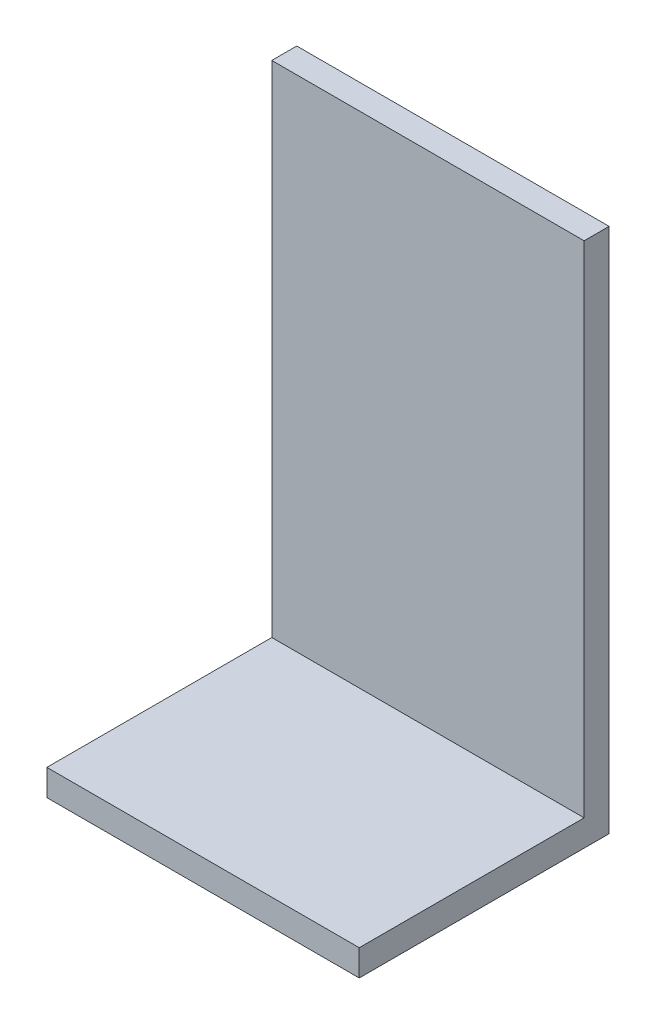
ISO-10303-21;
HEADER;
FILE_DESCRIPTION(('STEP AP214'),'2;1');
FILE_NAME('part.step','',(''),(''),'','','');
FILE_SCHEMA(('AUTOMOTIVE_DESIGN { 1 0 10303 214 1 1 1 1 }'));
ENDSEC;
DATA;
#1=APPLICATION_CONTEXT('core data for automotive mechanical design processes');
#2=APPLICATION_PROTOCOL_DEFINITION('international standard','automotive_design',2000,#1);
#3=PRODUCT_CONTEXT('',#1,'mechanical');
#4=PRODUCT('Part','Part','',(#3));
#5=PRODUCT_RELATED_PRODUCT_CATEGORY('part','',(#4));
#6=PRODUCT_DEFINITION_FORMATION('','',#4);
#7=PRODUCT_DEFINITION_CONTEXT('part definition',#1,'design');
#8=PRODUCT_DEFINITION('design','',#6,#7);
#9=PRODUCT_DEFINITION_SHAPE('','',#8);
#10=(LENGTH_UNIT() NAMED_UNIT(*) SI_UNIT(.MILLI.,.METRE.));
#11=(NAMED_UNIT(*) PLANE_ANGLE_UNIT() SI_UNIT($,.RADIAN.));
#12=(NAMED_UNIT(*) SI_UNIT($,.STERADIAN.) SOLID_ANGLE_UNIT());
#13=UNCERTAINTY_MEASURE_WITH_UNIT(LENGTH_MEASURE(1.E-05),#10,'distance_accuracy_value','');
#14=(GEOMETRIC_REPRESENTATION_CONTEXT(3) GLOBAL_UNCERTAINTY_ASSIGNED_CONTEXT((#13)) GLOBAL_UNIT_ASSIGNED_CONTEXT((#10,
#11,#12)) REPRESENTATION_CONTEXT('',''));
#15=CARTESIAN_POINT('',(0.,0.,0.));
#16=DIRECTION('',(0.,0.,1.));
#17=DIRECTION('',(1.,0.,0.));
#18=AXIS2_PLACEMENT_3D('',#15,#16,#17);
#19=CARTESIAN_POINT('',(0.22167930040457,-1.5105,0.2));
#20=DIRECTION('',(0.,0.,1.));
#21=DIRECTION('',(0.,-1.,0.));
#22=AXIS2_PLACEMENT_3D('',#19,#20,#21);
#23=PLANE('',#22);
#24=DIRECTION('',(0.,-1.,0.));
#25=VECTOR('',#24,1.);
#26=CARTESIAN_POINT('',(0.0966793004045692,-1.36847101449275,0.2));
#27=LINE('',#26,#25);
#28=CARTESIAN_POINT('',(0.0966793004045694,-1.5,0.2));
#29=VERTEX_POINT('',#28);
#30=CARTESIAN_POINT('',(0.0966793004045697,-1.521,0.2));
#31=VERTEX_POINT('',#30);
#32=EDGE_CURVE('E104',#29,#31,#27,.T.);
#33=ORIENTED_EDGE('',*,*,#32,.T.);
#34=DIRECTION('',(1.,0.,0.));
#35=VECTOR('',#34,1.);
#36=CARTESIAN_POINT('',(0.22167930040457,-1.521,0.2));
#37=LINE('',#36,#35);
#38=CARTESIAN_POINT('',(0.34667930040457,-1.521,0.2));
#39=VERTEX_POINT('',#38);
#40=EDGE_CURVE('E100',#31,#39,#37,.T.);
#41=ORIENTED_EDGE('',*,*,#40,.T.);
#42=DIRECTION('',(0.,-1.,0.));
#43=VECTOR('',#42,1.);
#44=CARTESIAN_POINT('',(0.346679300404569,-1.36847101449275,0.2));
#45=LINE('',#44,#43);
#46=CARTESIAN_POINT('',(0.34667930040457,-1.5,0.2));
#47=VERTEX_POINT('',#46);
#48=EDGE_CURVE('E145',#47,#39,#45,.T.);
#49=ORIENTED_EDGE('',*,*,#48,.F.);
#50=DIRECTION('',(1.,0.,0.));
#51=VECTOR('',#50,1.);
#52=CARTESIAN_POINT('',(0.22167930040457,-1.5,0.2));
#53=LINE('',#52,#51);
#54=EDGE_CURVE('E27',#29,#47,#53,.T.);
#55=ORIENTED_EDGE('',*,*,#54,.F.);
#56=EDGE_LOOP('',(#33,#41,#49,#55));
#57=FACE_BOUND('',#56,.T.);
#58=ADVANCED_FACE('F16',(#57),#23,.T.);
#59=CARTESIAN_POINT('',(0.221679300404569,-1.3,0.02));
#60=DIRECTION('',(0.,0.,1.));
#61=DIRECTION('',(0.,-1.,0.));
#62=AXIS2_PLACEMENT_3D('',#59,#60,#61);
#63=PLANE('',#62);
#64=DIRECTION('',(0.,-1.,0.));
#65=VECTOR('',#64,1.);
#66=CARTESIAN_POINT('',(0.346679300404569,-1.36847101449275,0.02));
#67=LINE('',#66,#65);
#68=CARTESIAN_POINT('',(0.346679300404568,-1.1,0.02));
#69=VERTEX_POINT('',#68);
#70=CARTESIAN_POINT('',(0.34667930040457,-1.5,0.02));
#71=VERTEX_POINT('',#70);
#72=EDGE_CURVE('E136',#69,#71,#67,.T.);
#73=ORIENTED_EDGE('',*,*,#72,.F.);
#74=DIRECTION('',(1.,0.,0.));
#75=VECTOR('',#74,1.);
#76=CARTESIAN_POINT('',(0.221679300404568,-1.1,0.02));
#77=LINE('',#76,#75);
#78=CARTESIAN_POINT('',(0.0966793004045681,-1.1,0.02));
#79=VERTEX_POINT('',#78);
#80=EDGE_CURVE('E42',#79,#69,#77,.T.);
#81=ORIENTED_EDGE('',*,*,#80,.F.);
#82=DIRECTION('',(0.,-1.,0.));
#83=VECTOR('',#82,1.);
#84=CARTESIAN_POINT('',(0.0966793004045692,-1.36847101449275,0.02));
#85=LINE('',#84,#83);
#86=CARTESIAN_POINT('',(0.0966793004045688,-1.5,0.02));
#87=VERTEX_POINT('',#86);
#88=EDGE_CURVE('E127',#79,#87,#85,.T.);
#89=ORIENTED_EDGE('',*,*,#88,.T.);
#90=DIRECTION('',(-1.,0.,0.));
#91=VECTOR('',#90,1.);
#92=CARTESIAN_POINT('',(0.22167930040457,-1.5,0.02));
#93=LINE('',#92,#91);
#94=EDGE_CURVE('E11',#71,#87,#93,.T.);
#95=ORIENTED_EDGE('',*,*,#94,.F.);
#96=EDGE_LOOP('',(#73,#81,#89,#95));
#97=FACE_BOUND('',#96,.T.);
#98=ADVANCED_FACE('F167',(#97),#63,.T.);
#99=CARTESIAN_POINT('',(0.22167930040457,-1.5,0.11));
#100=DIRECTION('',(0.,1.,0.));
#101=DIRECTION('',(1.,0.,0.));
#102=AXIS2_PLACEMENT_3D('',#99,#100,#101);
#103=PLANE('',#102);
#104=DIRECTION('',(0.,0.,1.));
#105=VECTOR('',#104,1.);
#106=CARTESIAN_POINT('',(0.0966793004045698,-1.5,0.0420289855072464));
#107=LINE('',#106,#105);
#108=EDGE_CURVE('E124',#87,#29,#107,.T.);
#109=ORIENTED_EDGE('',*,*,#108,.T.);
#110=ORIENTED_EDGE('',*,*,#54,.T.);
#111=DIRECTION('',(0.,0.,1.));
#112=VECTOR('',#111,1.);
#113=CARTESIAN_POINT('',(0.34667930040457,-1.5,0.0420289855072464));
#114=LINE('',#113,#112);
#115=EDGE_CURVE('E139',#71,#47,#114,.T.);
#116=ORIENTED_EDGE('',*,*,#115,.F.);
#117=ORIENTED_EDGE('',*,*,#94,.T.);
#118=EDGE_LOOP('',(#109,#110,#116,#117));
#119=FACE_BOUND('',#118,.T.);
#120=ADVANCED_FACE('F166',(#119),#103,.T.);
#121=CARTESIAN_POINT('',(0.221679300404568,-1.1,0.01));
#122=DIRECTION('',(0.,1.,0.));
#123=DIRECTION('',(1.,0.,0.));
#124=AXIS2_PLACEMENT_3D('',#121,#122,#123);
#125=PLANE('',#124);
#126=DIRECTION('',(0.,0.,1.));
#127=VECTOR('',#126,1.);
#128=CARTESIAN_POINT('',(0.346679300404568,-1.1,0.0420289855072464));
#129=LINE('',#128,#127);
#130=CARTESIAN_POINT('',(0.346679300404568,-1.1,0.));
#131=VERTEX_POINT('',#130);
#132=EDGE_CURVE('E132',#131,#69,#129,.T.);
#133=ORIENTED_EDGE('',*,*,#132,.F.);
#134=DIRECTION('',(-1.,0.,0.));
#135=VECTOR('',#134,1.);
#136=CARTESIAN_POINT('',(0.221679300404569,-1.1,0.));
#137=LINE('',#136,#135);
#138=CARTESIAN_POINT('',(0.0966793004045681,-1.1,0.));
#139=VERTEX_POINT('',#138);
#140=EDGE_CURVE('E20',#131,#139,#137,.T.);
#141=ORIENTED_EDGE('',*,*,#140,.T.);
#142=DIRECTION('',(0.,0.,1.));
#143=VECTOR('',#142,1.);
#144=CARTESIAN_POINT('',(0.0966793004045681,-1.1,0.0420289855072464));
#145=LINE('',#144,#143);
#146=EDGE_CURVE('E110',#139,#79,#145,.T.);
#147=ORIENTED_EDGE('',*,*,#146,.T.);
#148=ORIENTED_EDGE('',*,*,#80,.T.);
#149=EDGE_LOOP('',(#133,#141,#147,#148));
#150=FACE_BOUND('',#149,.T.);
#151=ADVANCED_FACE('F175',(#150),#125,.T.);
#152=CARTESIAN_POINT('',(0.0966793004045692,-1.36847101449275,0.0420289855072464));
#153=DIRECTION('',(1.,0.,0.));
#154=DIRECTION('',(0.,1.,0.));
#155=AXIS2_PLACEMENT_3D('',#152,#153,#154);
#156=PLANE('',#155);
#157=DIRECTION('',(0.,0.,1.));
#158=VECTOR('',#157,1.);
#159=CARTESIAN_POINT('',(0.0966793004045695,-1.521,0.1));
#160=LINE('',#159,#158);
#161=CARTESIAN_POINT('',(0.0966793004045693,-1.521,0.));
#162=VERTEX_POINT('',#161);
#163=EDGE_CURVE('E96',#162,#31,#160,.T.);
#164=ORIENTED_EDGE('',*,*,#163,.T.);
#165=ORIENTED_EDGE('',*,*,#32,.F.);
#166=ORIENTED_EDGE('',*,*,#108,.F.);
#167=ORIENTED_EDGE('',*,*,#88,.F.);
#168=ORIENTED_EDGE('',*,*,#146,.F.);
#169=DIRECTION('',(0.,-1.,0.));
#170=VECTOR('',#169,1.);
#171=CARTESIAN_POINT('',(0.0966793004045682,-1.3105,0.));
#172=LINE('',#171,#170);
#173=EDGE_CURVE('E107',#139,#162,#172,.T.);
#174=ORIENTED_EDGE('',*,*,#173,.T.);
#175=EDGE_LOOP('',(#164,#165,#166,#167,#168,#174));
#176=FACE_BOUND('',#175,.T.);
#177=ADVANCED_FACE('F108',(#176),#156,.F.);
#178=CARTESIAN_POINT('',(0.22167930040457,-1.521,0.1));
#179=DIRECTION('',(0.,1.,0.));
#180=DIRECTION('',(1.,0.,0.));
#181=AXIS2_PLACEMENT_3D('',#178,#179,#180);
#182=PLANE('',#181);
#183=DIRECTION('',(1.,0.,0.));
#184=VECTOR('',#183,1.);
#185=CARTESIAN_POINT('',(0.221679300404569,-1.521,0.));
#186=LINE('',#185,#184);
#187=CARTESIAN_POINT('',(0.34667930040457,-1.521,0.));
#188=VERTEX_POINT('',#187);
#189=EDGE_CURVE('E99',#162,#188,#186,.T.);
#190=ORIENTED_EDGE('',*,*,#189,.T.);
#191=DIRECTION('',(0.,0.,-1.));
#192=VECTOR('',#191,1.);
#193=CARTESIAN_POINT('',(0.34667930040457,-1.521,0.0420289855072464));
#194=LINE('',#193,#192);
#195=EDGE_CURVE('E86',#39,#188,#194,.T.);
#196=ORIENTED_EDGE('',*,*,#195,.F.);
#197=ORIENTED_EDGE('',*,*,#40,.F.);
#198=ORIENTED_EDGE('',*,*,#163,.F.);
#199=EDGE_LOOP('',(#190,#196,#197,#198));
#200=FACE_BOUND('',#199,.T.);
#201=ADVANCED_FACE('F18',(#200),#182,.F.);
#202=CARTESIAN_POINT('',(0.346679300404569,-1.36847101449275,0.0420289855072464));
#203=DIRECTION('',(1.,0.,0.));
#204=DIRECTION('',(0.,1.,0.));
#205=AXIS2_PLACEMENT_3D('',#202,#203,#204);
#206=PLANE('',#205);
#207=ORIENTED_EDGE('',*,*,#72,.T.);
#208=ORIENTED_EDGE('',*,*,#115,.T.);
#209=ORIENTED_EDGE('',*,*,#48,.T.);
#210=ORIENTED_EDGE('',*,*,#195,.T.);
#211=DIRECTION('',(0.,1.,0.));
#212=VECTOR('',#211,1.);
#213=CARTESIAN_POINT('',(0.346679300404569,-1.3105,0.));
#214=LINE('',#213,#212);
#215=EDGE_CURVE('E117',#188,#131,#214,.T.);
#216=ORIENTED_EDGE('',*,*,#215,.T.);
#217=ORIENTED_EDGE('',*,*,#132,.T.);
#218=EDGE_LOOP('',(#207,#208,#209,#210,#216,#217));
#219=FACE_BOUND('',#218,.T.);
#220=ADVANCED_FACE('F161',(#219),#206,.T.);
#221=CARTESIAN_POINT('',(0.221679300404569,-1.3105,0.));
#222=DIRECTION('',(0.,0.,1.));
#223=DIRECTION('',(0.,-1.,0.));
#224=AXIS2_PLACEMENT_3D('',#221,#222,#223);
#225=PLANE('',#224);
#226=ORIENTED_EDGE('',*,*,#189,.F.);
#227=ORIENTED_EDGE('',*,*,#173,.F.);
#228=ORIENTED_EDGE('',*,*,#140,.F.);
#229=ORIENTED_EDGE('',*,*,#215,.F.);
#230=EDGE_LOOP('',(#226,#227,#228,#229));
#231=FACE_BOUND('',#230,.T.);
#232=ADVANCED_FACE('F116',(#231),#225,.F.);
#233=CLOSED_SHELL('',(#58,#98,#120,#151,#177,#201,#220,#232));
#234=MANIFOLD_SOLID_BREP('B1',#233);
#235=ADVANCED_BREP_SHAPE_REPRESENTATION('',(#18,#234),#14);
#236=SHAPE_DEFINITION_REPRESENTATION(#9,#235);
ENDSEC;
END-ISO-10303-21;
